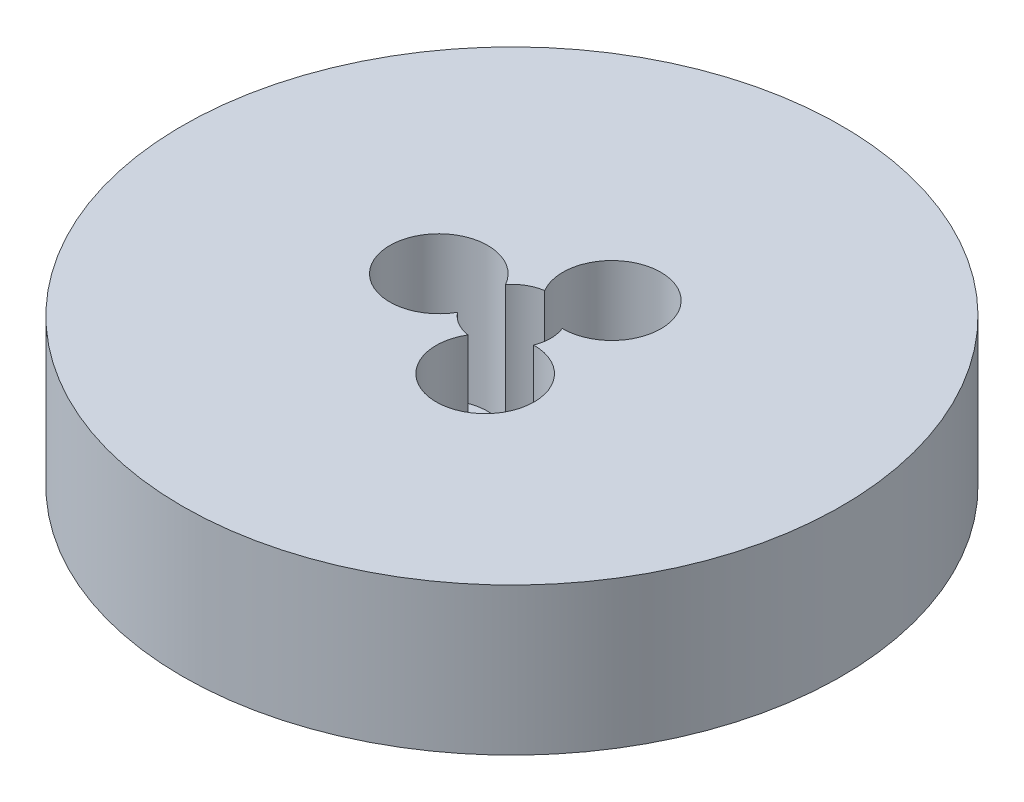
ISO-10303-21;
HEADER;
FILE_DESCRIPTION(('STEP AP214'),'2;1');
FILE_NAME('part.step','',(''),(''),'','','');
FILE_SCHEMA(('AUTOMOTIVE_DESIGN { 1 0 10303 214 1 1 1 1 }'));
ENDSEC;
DATA;
#1=APPLICATION_CONTEXT('core data for automotive mechanical design processes');
#2=APPLICATION_PROTOCOL_DEFINITION('international standard','automotive_design',2000,#1);
#3=PRODUCT_CONTEXT('',#1,'mechanical');
#4=PRODUCT('Part','Part','',(#3));
#5=PRODUCT_RELATED_PRODUCT_CATEGORY('part','',(#4));
#6=PRODUCT_DEFINITION_FORMATION('','',#4);
#7=PRODUCT_DEFINITION_CONTEXT('part definition',#1,'design');
#8=PRODUCT_DEFINITION('design','',#6,#7);
#9=PRODUCT_DEFINITION_SHAPE('','',#8);
#10=(LENGTH_UNIT() NAMED_UNIT(*) SI_UNIT(.MILLI.,.METRE.));
#11=(NAMED_UNIT(*) PLANE_ANGLE_UNIT() SI_UNIT($,.RADIAN.));
#12=(NAMED_UNIT(*) SI_UNIT($,.STERADIAN.) SOLID_ANGLE_UNIT());
#13=UNCERTAINTY_MEASURE_WITH_UNIT(LENGTH_MEASURE(1.E-05),#10,'distance_accuracy_value','');
#14=(GEOMETRIC_REPRESENTATION_CONTEXT(3) GLOBAL_UNCERTAINTY_ASSIGNED_CONTEXT((#13)) GLOBAL_UNIT_ASSIGNED_CONTEXT((#10,
#11,#12)) REPRESENTATION_CONTEXT('',''));
#15=CARTESIAN_POINT('',(0.,0.,0.));
#16=DIRECTION('',(0.,0.,1.));
#17=DIRECTION('',(1.,0.,0.));
#18=AXIS2_PLACEMENT_3D('',#15,#16,#17);
#19=CARTESIAN_POINT('',(0.,19.,0.));
#20=DIRECTION('',(0.,-1.,0.));
#21=DIRECTION('',(0.,0.,-1.));
#22=AXIS2_PLACEMENT_3D('',#19,#20,#21);
#23=CYLINDRICAL_SURFACE('',#22,42.5);
#24=CARTESIAN_POINT('',(0.,19.,0.));
#25=DIRECTION('',(0.,1.,0.));
#26=DIRECTION('',(0.,0.,1.));
#27=AXIS2_PLACEMENT_3D('',#24,#25,#26);
#28=CIRCLE('',#27,42.5);
#29=CARTESIAN_POINT('',(0.,19.,42.5));
#30=VERTEX_POINT('',#29);
#31=EDGE_CURVE('E126',#30,#30,#28,.T.);
#32=ORIENTED_EDGE('',*,*,#31,.F.);
#33=EDGE_LOOP('',(#32));
#34=FACE_BOUND('',#33,.T.);
#35=CARTESIAN_POINT('',(0.,0.,0.));
#36=DIRECTION('',(0.,1.,0.));
#37=DIRECTION('',(0.,0.,1.));
#38=AXIS2_PLACEMENT_3D('',#35,#36,#37);
#39=CIRCLE('',#38,42.5);
#40=CARTESIAN_POINT('',(0.,0.,42.5));
#41=VERTEX_POINT('',#40);
#42=EDGE_CURVE('E124',#41,#41,#39,.T.);
#43=ORIENTED_EDGE('',*,*,#42,.T.);
#44=EDGE_LOOP('',(#43));
#45=FACE_BOUND('',#44,.T.);
#46=ADVANCED_FACE('F39',(#34,#45),#23,.T.);
#47=CARTESIAN_POINT('',(0.,19.,0.));
#48=DIRECTION('',(0.,1.,0.));
#49=DIRECTION('',(0.,0.,1.));
#50=AXIS2_PLACEMENT_3D('',#47,#48,#49);
#51=PLANE('',#50);
#52=CARTESIAN_POINT('',(4.71603065764128,19.,8.16840470908707));
#53=DIRECTION('',(0.,1.,0.));
#54=DIRECTION('',(0.866025403784436,0.,-0.500000000000004));
#55=AXIS2_PLACEMENT_3D('',#52,#53,#54);
#56=CIRCLE('',#55,6.32190009525326);
#57=CARTESIAN_POINT('',(-0.723746424032026,19.,4.94734182300969));
#58=VERTEX_POINT('',#57);
#59=CARTESIAN_POINT('',(4.64639691194764,19.,1.84688812239492));
#60=VERTEX_POINT('',#59);
#61=EDGE_CURVE('E147',#58,#60,#56,.T.);
#62=ORIENTED_EDGE('',*,*,#61,.F.);
#63=CARTESIAN_POINT('',(0.,19.,0.));
#64=DIRECTION('',(0.,1.,0.));
#65=DIRECTION('',(0.,0.,1.));
#66=AXIS2_PLACEMENT_3D('',#63,#64,#65);
#67=CIRCLE('',#66,5.);
#68=CARTESIAN_POINT('',(-3.92265048791558,19.,3.10045370061474));
#69=VERTEX_POINT('',#68);
#70=EDGE_CURVE('E118',#69,#58,#67,.T.);
#71=ORIENTED_EDGE('',*,*,#70,.F.);
#72=CARTESIAN_POINT('',(-9.43206131528248,19.,0.));
#73=DIRECTION('',(0.,1.,0.));
#74=DIRECTION('',(0.,0.,1.));
#75=AXIS2_PLACEMENT_3D('',#72,#73,#74);
#76=CIRCLE('',#75,6.32190009525326);
#77=CARTESIAN_POINT('',(-3.92265048791558,19.,-3.10045370061474));
#78=VERTEX_POINT('',#77);
#79=EDGE_CURVE('E113',#78,#69,#76,.T.);
#80=ORIENTED_EDGE('',*,*,#79,.F.);
#81=CARTESIAN_POINT('',(-0.723746424032097,19.,-4.94734182300968));
#82=VERTEX_POINT('',#81);
#83=EDGE_CURVE('E106',#82,#78,#67,.T.);
#84=ORIENTED_EDGE('',*,*,#83,.F.);
#85=CARTESIAN_POINT('',(4.71603065764116,19.,-8.16840470908713));
#86=DIRECTION('',(0.,1.,0.));
#87=DIRECTION('',(-0.866025403784443,0.,-0.499999999999992));
#88=AXIS2_PLACEMENT_3D('',#85,#86,#87);
#89=CIRCLE('',#88,6.32190009525326);
#90=CARTESIAN_POINT('',(4.64639691194761,19.,-1.84688812239499));
#91=VERTEX_POINT('',#90);
#92=EDGE_CURVE('E90',#91,#82,#89,.T.);
#93=ORIENTED_EDGE('',*,*,#92,.F.);
#94=EDGE_CURVE('E116',#60,#91,#67,.T.);
#95=ORIENTED_EDGE('',*,*,#94,.F.);
#96=EDGE_LOOP('',(#62,#71,#80,#84,#93,#95));
#97=FACE_BOUND('',#96,.T.);
#98=ORIENTED_EDGE('',*,*,#31,.T.);
#99=EDGE_LOOP('',(#98));
#100=FACE_BOUND('',#99,.T.);
#101=ADVANCED_FACE('F115',(#97,#100),#51,.T.);
#102=CARTESIAN_POINT('',(0.,0.,0.));
#103=DIRECTION('',(0.,1.,0.));
#104=DIRECTION('',(0.,0.,1.));
#105=AXIS2_PLACEMENT_3D('',#102,#103,#104);
#106=PLANE('',#105);
#107=CARTESIAN_POINT('',(0.,0.,0.));
#108=DIRECTION('',(0.,1.,0.));
#109=DIRECTION('',(0.,0.,1.));
#110=AXIS2_PLACEMENT_3D('',#107,#108,#109);
#111=CIRCLE('',#110,5.);
#112=CARTESIAN_POINT('',(0.,0.,5.));
#113=VERTEX_POINT('',#112);
#114=EDGE_CURVE('E120',#113,#113,#111,.T.);
#115=ORIENTED_EDGE('',*,*,#114,.T.);
#116=EDGE_LOOP('',(#115));
#117=FACE_BOUND('',#116,.T.);
#118=ORIENTED_EDGE('',*,*,#42,.F.);
#119=EDGE_LOOP('',(#118));
#120=FACE_BOUND('',#119,.T.);
#121=ADVANCED_FACE('F164',(#117,#120),#106,.F.);
#122=CARTESIAN_POINT('',(0.,19.,0.));
#123=DIRECTION('',(0.,-1.,0.));
#124=DIRECTION('',(0.,0.,-1.));
#125=AXIS2_PLACEMENT_3D('',#122,#123,#124);
#126=CYLINDRICAL_SURFACE('',#125,5.);
#127=DIRECTION('',(0.,1.,0.));
#128=VECTOR('',#127,1.);
#129=CARTESIAN_POINT('',(-0.723746424032026,9.73670197032078,4.94734182300969));
#130=LINE('',#129,#128);
#131=CARTESIAN_POINT('',(-0.723746424032026,0.473403940641555,4.94734182300969));
#132=VERTEX_POINT('',#131);
#133=EDGE_CURVE('E11',#132,#58,#130,.T.);
#134=ORIENTED_EDGE('',*,*,#133,.F.);
#135=CARTESIAN_POINT('',(0.,0.473403940641555,0.));
#136=DIRECTION('',(0.,1.,0.));
#137=DIRECTION('',(0.,0.,1.));
#138=AXIS2_PLACEMENT_3D('',#135,#136,#137);
#139=CIRCLE('',#138,5.);
#140=CARTESIAN_POINT('',(4.64639691194764,0.473403940641555,1.84688812239492));
#141=VERTEX_POINT('',#140);
#142=EDGE_CURVE('E144',#132,#141,#139,.T.);
#143=ORIENTED_EDGE('',*,*,#142,.T.);
#144=DIRECTION('',(0.,1.,0.));
#145=VECTOR('',#144,1.);
#146=CARTESIAN_POINT('',(4.64639691194764,9.73670197032078,1.84688812239492));
#147=LINE('',#146,#145);
#148=EDGE_CURVE('E46',#60,#141,#147,.F.);
#149=ORIENTED_EDGE('',*,*,#148,.F.);
#150=ORIENTED_EDGE('',*,*,#94,.T.);
#151=DIRECTION('',(0.,1.,0.));
#152=VECTOR('',#151,1.);
#153=CARTESIAN_POINT('',(4.64639691194761,9.73670197032078,-1.84688812239499));
#154=LINE('',#153,#152);
#155=CARTESIAN_POINT('',(4.64639691194761,0.473403940641555,-1.84688812239499));
#156=VERTEX_POINT('',#155);
#157=EDGE_CURVE('E92',#156,#91,#154,.T.);
#158=ORIENTED_EDGE('',*,*,#157,.F.);
#159=CARTESIAN_POINT('',(0.,0.473403940641555,0.));
#160=DIRECTION('',(0.,1.,0.));
#161=DIRECTION('',(0.,0.,1.));
#162=AXIS2_PLACEMENT_3D('',#159,#160,#161);
#163=CIRCLE('',#162,5.);
#164=CARTESIAN_POINT('',(-0.723746424032097,0.473403940641555,-4.94734182300968));
#165=VERTEX_POINT('',#164);
#166=EDGE_CURVE('E107',#156,#165,#163,.T.);
#167=ORIENTED_EDGE('',*,*,#166,.T.);
#168=DIRECTION('',(0.,1.,0.));
#169=VECTOR('',#168,1.);
#170=CARTESIAN_POINT('',(-0.723746424032096,9.73670197032078,-4.94734182300968));
#171=LINE('',#170,#169);
#172=EDGE_CURVE('E95',#82,#165,#171,.F.);
#173=ORIENTED_EDGE('',*,*,#172,.F.);
#174=ORIENTED_EDGE('',*,*,#83,.T.);
#175=DIRECTION('',(0.,1.,0.));
#176=VECTOR('',#175,1.);
#177=CARTESIAN_POINT('',(-3.92265048791558,9.73670197032078,-3.10045370061474));
#178=LINE('',#177,#176);
#179=CARTESIAN_POINT('',(-3.92265048791558,0.473403940641555,-3.10045370061474));
#180=VERTEX_POINT('',#179);
#181=EDGE_CURVE('E143',#180,#78,#178,.T.);
#182=ORIENTED_EDGE('',*,*,#181,.F.);
#183=CARTESIAN_POINT('',(0.,0.473403940641555,0.));
#184=DIRECTION('',(0.,1.,0.));
#185=DIRECTION('',(0.,0.,1.));
#186=AXIS2_PLACEMENT_3D('',#183,#184,#185);
#187=CIRCLE('',#186,5.);
#188=CARTESIAN_POINT('',(-3.92265048791558,0.473403940641555,3.10045370061474));
#189=VERTEX_POINT('',#188);
#190=EDGE_CURVE('E132',#180,#189,#187,.T.);
#191=ORIENTED_EDGE('',*,*,#190,.T.);
#192=DIRECTION('',(0.,1.,0.));
#193=VECTOR('',#192,1.);
#194=CARTESIAN_POINT('',(-3.92265048791558,9.73670197032078,3.10045370061474));
#195=LINE('',#194,#193);
#196=EDGE_CURVE('E137',#69,#189,#195,.F.);
#197=ORIENTED_EDGE('',*,*,#196,.F.);
#198=ORIENTED_EDGE('',*,*,#70,.T.);
#199=EDGE_LOOP('',(#134,#143,#149,#150,#158,#167,#173,#174,#182,#191,#197,#198));
#200=FACE_BOUND('',#199,.T.);
#201=ORIENTED_EDGE('',*,*,#114,.F.);
#202=EDGE_LOOP('',(#201));
#203=FACE_BOUND('',#202,.T.);
#204=ADVANCED_FACE('F103',(#200,#203),#126,.F.);
#205=CARTESIAN_POINT('',(-9.43206131528248,0.473403940641555,0.));
#206=DIRECTION('',(0.,1.,0.));
#207=DIRECTION('',(0.,0.,1.));
#208=AXIS2_PLACEMENT_3D('',#205,#206,#207);
#209=CYLINDRICAL_SURFACE('',#208,6.32190009525326);
#210=ORIENTED_EDGE('',*,*,#181,.T.);
#211=ORIENTED_EDGE('',*,*,#79,.T.);
#212=ORIENTED_EDGE('',*,*,#196,.T.);
#213=CARTESIAN_POINT('',(-9.43206131528248,0.473403940641555,0.));
#214=DIRECTION('',(0.,1.,0.));
#215=DIRECTION('',(0.,0.,1.));
#216=AXIS2_PLACEMENT_3D('',#213,#214,#215);
#217=CIRCLE('',#216,6.32190009525326);
#218=EDGE_CURVE('E121',#180,#189,#217,.T.);
#219=ORIENTED_EDGE('',*,*,#218,.F.);
#220=EDGE_LOOP('',(#210,#211,#212,#219));
#221=FACE_BOUND('',#220,.T.);
#222=ADVANCED_FACE('F174',(#221),#209,.F.);
#223=CARTESIAN_POINT('',(-9.43206131528248,0.473403940641555,0.));
#224=DIRECTION('',(0.,1.,0.));
#225=DIRECTION('',(0.,0.,1.));
#226=AXIS2_PLACEMENT_3D('',#223,#224,#225);
#227=PLANE('',#226);
#228=ORIENTED_EDGE('',*,*,#218,.T.);
#229=ORIENTED_EDGE('',*,*,#190,.F.);
#230=EDGE_LOOP('',(#228,#229));
#231=FACE_BOUND('',#230,.T.);
#232=ADVANCED_FACE('F177',(#231),#227,.T.);
#233=CARTESIAN_POINT('',(4.71603065764116,0.473403940641555,-8.16840470908713));
#234=DIRECTION('',(0.,1.,0.));
#235=DIRECTION('',(0.,0.,1.));
#236=AXIS2_PLACEMENT_3D('',#233,#234,#235);
#237=CYLINDRICAL_SURFACE('',#236,6.32190009525326);
#238=ORIENTED_EDGE('',*,*,#157,.T.);
#239=ORIENTED_EDGE('',*,*,#92,.T.);
#240=ORIENTED_EDGE('',*,*,#172,.T.);
#241=CARTESIAN_POINT('',(4.71603065764116,0.473403940641555,-8.16840470908713));
#242=DIRECTION('',(0.,1.,0.));
#243=DIRECTION('',(-0.866025403784443,0.,-0.499999999999992));
#244=AXIS2_PLACEMENT_3D('',#241,#242,#243);
#245=CIRCLE('',#244,6.32190009525326);
#246=EDGE_CURVE('E56',#156,#165,#245,.T.);
#247=ORIENTED_EDGE('',*,*,#246,.F.);
#248=EDGE_LOOP('',(#238,#239,#240,#247));
#249=FACE_BOUND('',#248,.T.);
#250=ADVANCED_FACE('F93',(#249),#237,.F.);
#251=CARTESIAN_POINT('',(4.71603065764116,0.473403940641555,-8.16840470908713));
#252=DIRECTION('',(0.,1.,0.));
#253=DIRECTION('',(-0.866025403784443,0.,-0.499999999999992));
#254=AXIS2_PLACEMENT_3D('',#251,#252,#253);
#255=PLANE('',#254);
#256=ORIENTED_EDGE('',*,*,#246,.T.);
#257=ORIENTED_EDGE('',*,*,#166,.F.);
#258=EDGE_LOOP('',(#256,#257));
#259=FACE_BOUND('',#258,.T.);
#260=ADVANCED_FACE('F160',(#259),#255,.T.);
#261=CARTESIAN_POINT('',(4.71603065764128,0.473403940641555,8.16840470908707));
#262=DIRECTION('',(0.,1.,0.));
#263=DIRECTION('',(0.,0.,1.));
#264=AXIS2_PLACEMENT_3D('',#261,#262,#263);
#265=CYLINDRICAL_SURFACE('',#264,6.32190009525326);
#266=ORIENTED_EDGE('',*,*,#133,.T.);
#267=ORIENTED_EDGE('',*,*,#61,.T.);
#268=ORIENTED_EDGE('',*,*,#148,.T.);
#269=CARTESIAN_POINT('',(4.71603065764128,0.473403940641555,8.16840470908707));
#270=DIRECTION('',(0.,1.,0.));
#271=DIRECTION('',(0.866025403784436,0.,-0.500000000000004));
#272=AXIS2_PLACEMENT_3D('',#269,#270,#271);
#273=CIRCLE('',#272,6.32190009525326);
#274=EDGE_CURVE('E55',#132,#141,#273,.T.);
#275=ORIENTED_EDGE('',*,*,#274,.F.);
#276=EDGE_LOOP('',(#266,#267,#268,#275));
#277=FACE_BOUND('',#276,.T.);
#278=ADVANCED_FACE('F149',(#277),#265,.F.);
#279=CARTESIAN_POINT('',(4.71603065764128,0.473403940641555,8.16840470908707));
#280=DIRECTION('',(0.,1.,0.));
#281=DIRECTION('',(0.866025403784436,0.,-0.500000000000004));
#282=AXIS2_PLACEMENT_3D('',#279,#280,#281);
#283=PLANE('',#282);
#284=ORIENTED_EDGE('',*,*,#274,.T.);
#285=ORIENTED_EDGE('',*,*,#142,.F.);
#286=EDGE_LOOP('',(#284,#285));
#287=FACE_BOUND('',#286,.T.);
#288=ADVANCED_FACE('F151',(#287),#283,.T.);
#289=CLOSED_SHELL('',(#46,#101,#121,#204,#222,#232,#250,#260,#278,#288));
#290=MANIFOLD_SOLID_BREP('B2',#289);
#291=ADVANCED_BREP_SHAPE_REPRESENTATION('',(#18,#290),#14);
#292=SHAPE_DEFINITION_REPRESENTATION(#9,#291);
ENDSEC;
END-ISO-10303-21;
